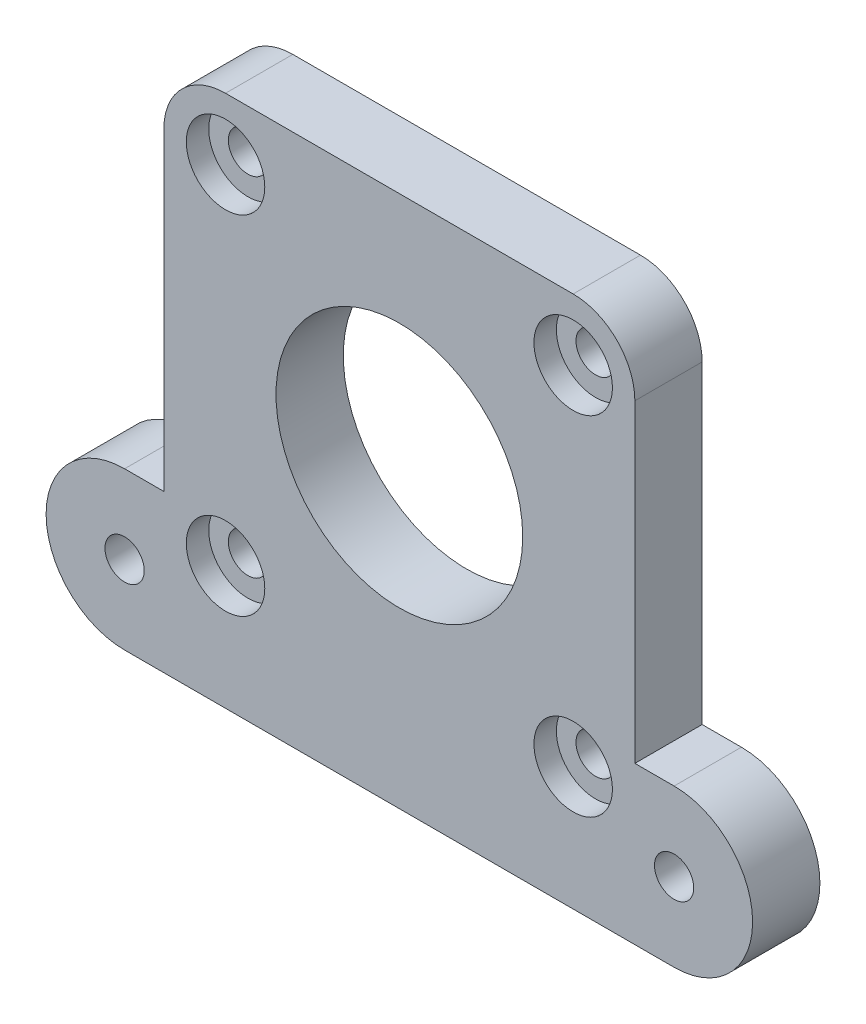
ISO-10303-21;
HEADER;
FILE_DESCRIPTION(('STEP AP214'),'2;1');
FILE_NAME('part.step','',(''),(''),'','','');
FILE_SCHEMA(('AUTOMOTIVE_DESIGN { 1 0 10303 214 1 1 1 1 }'));
ENDSEC;
DATA;
#1=APPLICATION_CONTEXT('core data for automotive mechanical design processes');
#2=APPLICATION_PROTOCOL_DEFINITION('international standard','automotive_design',2000,#1);
#3=PRODUCT_CONTEXT('',#1,'mechanical');
#4=PRODUCT('Part','Part','',(#3));
#5=PRODUCT_RELATED_PRODUCT_CATEGORY('part','',(#4));
#6=PRODUCT_DEFINITION_FORMATION('','',#4);
#7=PRODUCT_DEFINITION_CONTEXT('part definition',#1,'design');
#8=PRODUCT_DEFINITION('design','',#6,#7);
#9=PRODUCT_DEFINITION_SHAPE('','',#8);
#10=(LENGTH_UNIT() NAMED_UNIT(*) SI_UNIT(.MILLI.,.METRE.));
#11=(NAMED_UNIT(*) PLANE_ANGLE_UNIT() SI_UNIT($,.RADIAN.));
#12=(NAMED_UNIT(*) SI_UNIT($,.STERADIAN.) SOLID_ANGLE_UNIT());
#13=UNCERTAINTY_MEASURE_WITH_UNIT(LENGTH_MEASURE(1.E-05),#10,'distance_accuracy_value','');
#14=(GEOMETRIC_REPRESENTATION_CONTEXT(3) GLOBAL_UNCERTAINTY_ASSIGNED_CONTEXT((#13)) GLOBAL_UNIT_ASSIGNED_CONTEXT((#10,
#11,#12)) REPRESENTATION_CONTEXT('',''));
#15=CARTESIAN_POINT('',(0.,0.,0.));
#16=DIRECTION('',(0.,0.,1.));
#17=DIRECTION('',(1.,0.,0.));
#18=AXIS2_PLACEMENT_3D('',#15,#16,#17);
#19=CARTESIAN_POINT('',(15.5,18.25,6.));
#20=DIRECTION('',(0.,0.,-1.));
#21=DIRECTION('',(-1.,0.,0.));
#22=AXIS2_PLACEMENT_3D('',#19,#20,#21);
#23=CYLINDRICAL_SURFACE('',#22,1.75);
#24=CARTESIAN_POINT('',(15.5,18.25,0.));
#25=DIRECTION('',(0.,0.,1.));
#26=DIRECTION('',(1.,0.,0.));
#27=AXIS2_PLACEMENT_3D('',#24,#25,#26);
#28=CIRCLE('',#27,1.75);
#29=CARTESIAN_POINT('',(17.25,18.25,0.));
#30=VERTEX_POINT('',#29);
#31=EDGE_CURVE('E187',#30,#30,#28,.T.);
#32=ORIENTED_EDGE('',*,*,#31,.F.);
#33=EDGE_LOOP('',(#32));
#34=FACE_BOUND('',#33,.T.);
#35=CARTESIAN_POINT('',(15.5,18.25,4.));
#36=DIRECTION('',(0.,0.,1.));
#37=DIRECTION('',(1.,0.,0.));
#38=AXIS2_PLACEMENT_3D('',#35,#36,#37);
#39=CIRCLE('',#38,1.75);
#40=CARTESIAN_POINT('',(17.25,18.25,4.));
#41=VERTEX_POINT('',#40);
#42=EDGE_CURVE('E37',#41,#41,#39,.T.);
#43=ORIENTED_EDGE('',*,*,#42,.T.);
#44=EDGE_LOOP('',(#43));
#45=FACE_BOUND('',#44,.T.);
#46=ADVANCED_FACE('F33',(#34,#45),#23,.F.);
#47=CARTESIAN_POINT('',(15.5,-12.75,6.));
#48=DIRECTION('',(0.,0.,-1.));
#49=DIRECTION('',(-1.,0.,0.));
#50=AXIS2_PLACEMENT_3D('',#47,#48,#49);
#51=CYLINDRICAL_SURFACE('',#50,1.75);
#52=CARTESIAN_POINT('',(15.5,-12.75,0.));
#53=DIRECTION('',(0.,0.,1.));
#54=DIRECTION('',(-1.,0.,0.));
#55=AXIS2_PLACEMENT_3D('',#52,#53,#54);
#56=CIRCLE('',#55,1.75);
#57=CARTESIAN_POINT('',(13.75,-12.75,0.));
#58=VERTEX_POINT('',#57);
#59=EDGE_CURVE('E184',#58,#58,#56,.T.);
#60=ORIENTED_EDGE('',*,*,#59,.F.);
#61=EDGE_LOOP('',(#60));
#62=FACE_BOUND('',#61,.T.);
#63=CARTESIAN_POINT('',(15.5,-12.75,4.));
#64=DIRECTION('',(0.,0.,1.));
#65=DIRECTION('',(1.,0.,0.));
#66=AXIS2_PLACEMENT_3D('',#63,#64,#65);
#67=CIRCLE('',#66,1.75);
#68=CARTESIAN_POINT('',(17.25,-12.75,4.));
#69=VERTEX_POINT('',#68);
#70=EDGE_CURVE('E161',#69,#69,#67,.T.);
#71=ORIENTED_EDGE('',*,*,#70,.T.);
#72=EDGE_LOOP('',(#71));
#73=FACE_BOUND('',#72,.T.);
#74=ADVANCED_FACE('F278',(#62,#73),#51,.F.);
#75=CARTESIAN_POINT('',(-15.5,18.25,6.));
#76=DIRECTION('',(0.,0.,-1.));
#77=DIRECTION('',(-1.,0.,0.));
#78=AXIS2_PLACEMENT_3D('',#75,#76,#77);
#79=CYLINDRICAL_SURFACE('',#78,1.75);
#80=CARTESIAN_POINT('',(-15.5,18.25,0.));
#81=DIRECTION('',(0.,0.,1.));
#82=DIRECTION('',(-1.,0.,0.));
#83=AXIS2_PLACEMENT_3D('',#80,#81,#82);
#84=CIRCLE('',#83,1.75);
#85=CARTESIAN_POINT('',(-17.25,18.25,0.));
#86=VERTEX_POINT('',#85);
#87=EDGE_CURVE('E181',#86,#86,#84,.T.);
#88=ORIENTED_EDGE('',*,*,#87,.F.);
#89=EDGE_LOOP('',(#88));
#90=FACE_BOUND('',#89,.T.);
#91=CARTESIAN_POINT('',(-15.5,18.25,4.));
#92=DIRECTION('',(0.,0.,1.));
#93=DIRECTION('',(1.,0.,0.));
#94=AXIS2_PLACEMENT_3D('',#91,#92,#93);
#95=CIRCLE('',#94,1.75);
#96=CARTESIAN_POINT('',(-13.75,18.25,4.));
#97=VERTEX_POINT('',#96);
#98=EDGE_CURVE('E158',#97,#97,#95,.T.);
#99=ORIENTED_EDGE('',*,*,#98,.T.);
#100=EDGE_LOOP('',(#99));
#101=FACE_BOUND('',#100,.T.);
#102=ADVANCED_FACE('F284',(#90,#101),#79,.F.);
#103=CARTESIAN_POINT('',(-15.5,-12.75,6.));
#104=DIRECTION('',(0.,0.,-1.));
#105=DIRECTION('',(-1.,0.,0.));
#106=AXIS2_PLACEMENT_3D('',#103,#104,#105);
#107=CYLINDRICAL_SURFACE('',#106,1.75);
#108=CARTESIAN_POINT('',(-15.5,-12.75,0.));
#109=DIRECTION('',(0.,0.,1.));
#110=DIRECTION('',(1.,0.,0.));
#111=AXIS2_PLACEMENT_3D('',#108,#109,#110);
#112=CIRCLE('',#111,1.75);
#113=CARTESIAN_POINT('',(-13.75,-12.75,0.));
#114=VERTEX_POINT('',#113);
#115=EDGE_CURVE('E175',#114,#114,#112,.T.);
#116=ORIENTED_EDGE('',*,*,#115,.F.);
#117=EDGE_LOOP('',(#116));
#118=FACE_BOUND('',#117,.T.);
#119=CARTESIAN_POINT('',(-15.5,-12.75,4.));
#120=DIRECTION('',(0.,0.,1.));
#121=DIRECTION('',(1.,0.,0.));
#122=AXIS2_PLACEMENT_3D('',#119,#120,#121);
#123=CIRCLE('',#122,1.75);
#124=CARTESIAN_POINT('',(-13.75,-12.75,4.));
#125=VERTEX_POINT('',#124);
#126=EDGE_CURVE('E155',#125,#125,#123,.T.);
#127=ORIENTED_EDGE('',*,*,#126,.T.);
#128=EDGE_LOOP('',(#127));
#129=FACE_BOUND('',#128,.T.);
#130=ADVANCED_FACE('F300',(#118,#129),#107,.F.);
#131=CARTESIAN_POINT('',(24.5,-16.75,6.));
#132=DIRECTION('',(0.,0.,1.));
#133=DIRECTION('',(1.,0.,0.));
#134=AXIS2_PLACEMENT_3D('',#131,#132,#133);
#135=PLANE('',#134);
#136=CARTESIAN_POINT('',(-15.5,18.25,6.));
#137=DIRECTION('',(0.,0.,1.));
#138=DIRECTION('',(1.,0.,0.));
#139=AXIS2_PLACEMENT_3D('',#136,#137,#138);
#140=CIRCLE('',#139,3.5);
#141=CARTESIAN_POINT('',(-12.,18.25,6.));
#142=VERTEX_POINT('',#141);
#143=EDGE_CURVE('E349',#142,#142,#140,.T.);
#144=ORIENTED_EDGE('',*,*,#143,.F.);
#145=EDGE_LOOP('',(#144));
#146=FACE_BOUND('',#145,.T.);
#147=CARTESIAN_POINT('',(-15.5,-12.75,6.));
#148=DIRECTION('',(0.,0.,1.));
#149=DIRECTION('',(1.,0.,0.));
#150=AXIS2_PLACEMENT_3D('',#147,#148,#149);
#151=CIRCLE('',#150,3.5);
#152=CARTESIAN_POINT('',(-12.,-12.75,6.));
#153=VERTEX_POINT('',#152);
#154=EDGE_CURVE('E348',#153,#153,#151,.T.);
#155=ORIENTED_EDGE('',*,*,#154,.F.);
#156=EDGE_LOOP('',(#155));
#157=FACE_BOUND('',#156,.T.);
#158=CARTESIAN_POINT('',(15.5,-12.75,6.));
#159=DIRECTION('',(0.,0.,1.));
#160=DIRECTION('',(1.,0.,0.));
#161=AXIS2_PLACEMENT_3D('',#158,#159,#160);
#162=CIRCLE('',#161,3.5);
#163=CARTESIAN_POINT('',(19.,-12.75,6.));
#164=VERTEX_POINT('',#163);
#165=EDGE_CURVE('E365',#164,#164,#162,.T.);
#166=ORIENTED_EDGE('',*,*,#165,.F.);
#167=EDGE_LOOP('',(#166));
#168=FACE_BOUND('',#167,.T.);
#169=CARTESIAN_POINT('',(15.5,18.25,6.));
#170=DIRECTION('',(0.,0.,1.));
#171=DIRECTION('',(1.,0.,0.));
#172=AXIS2_PLACEMENT_3D('',#169,#170,#171);
#173=CIRCLE('',#172,3.5);
#174=CARTESIAN_POINT('',(19.,18.25,6.));
#175=VERTEX_POINT('',#174);
#176=EDGE_CURVE('E359',#175,#175,#173,.T.);
#177=ORIENTED_EDGE('',*,*,#176,.F.);
#178=EDGE_LOOP('',(#177));
#179=FACE_BOUND('',#178,.T.);
#180=CARTESIAN_POINT('',(0.,2.75000000000001,6.));
#181=DIRECTION('',(0.,0.,1.));
#182=DIRECTION('',(1.,0.,0.));
#183=AXIS2_PLACEMENT_3D('',#180,#181,#182);
#184=CIRCLE('',#183,11.);
#185=CARTESIAN_POINT('',(11.,2.75000000000001,6.));
#186=VERTEX_POINT('',#185);
#187=EDGE_CURVE('E191',#186,#186,#184,.T.);
#188=ORIENTED_EDGE('',*,*,#187,.F.);
#189=EDGE_LOOP('',(#188));
#190=FACE_BOUND('',#189,.T.);
#191=DIRECTION('',(0.,1.,0.));
#192=VECTOR('',#191,1.);
#193=CARTESIAN_POINT('',(21.,23.75,6.));
#194=LINE('',#193,#192);
#195=CARTESIAN_POINT('',(21.,-9.75000000000001,6.));
#196=VERTEX_POINT('',#195);
#197=CARTESIAN_POINT('',(21.,18.25,6.));
#198=VERTEX_POINT('',#197);
#199=EDGE_CURVE('E204',#196,#198,#194,.T.);
#200=ORIENTED_EDGE('',*,*,#199,.T.);
#201=CARTESIAN_POINT('',(15.5,18.25,6.));
#202=DIRECTION('',(0.,0.,1.));
#203=DIRECTION('',(1.,0.,0.));
#204=AXIS2_PLACEMENT_3D('',#201,#202,#203);
#205=CIRCLE('',#204,5.5);
#206=CARTESIAN_POINT('',(15.5,23.75,6.));
#207=VERTEX_POINT('',#206);
#208=EDGE_CURVE('E42',#198,#207,#205,.T.);
#209=ORIENTED_EDGE('',*,*,#208,.T.);
#210=DIRECTION('',(-1.,0.,0.));
#211=VECTOR('',#210,1.);
#212=CARTESIAN_POINT('',(-21.,23.75,6.));
#213=LINE('',#212,#211);
#214=CARTESIAN_POINT('',(-15.5,23.75,6.));
#215=VERTEX_POINT('',#214);
#216=EDGE_CURVE('E206',#207,#215,#213,.T.);
#217=ORIENTED_EDGE('',*,*,#216,.T.);
#218=CARTESIAN_POINT('',(-15.5,18.25,6.));
#219=DIRECTION('',(0.,0.,1.));
#220=DIRECTION('',(1.,0.,0.));
#221=AXIS2_PLACEMENT_3D('',#218,#219,#220);
#222=CIRCLE('',#221,5.5);
#223=CARTESIAN_POINT('',(-21.,18.25,6.));
#224=VERTEX_POINT('',#223);
#225=EDGE_CURVE('E50',#215,#224,#222,.T.);
#226=ORIENTED_EDGE('',*,*,#225,.T.);
#227=DIRECTION('',(0.,-1.,0.));
#228=VECTOR('',#227,1.);
#229=CARTESIAN_POINT('',(-21.,23.75,6.));
#230=LINE('',#229,#228);
#231=CARTESIAN_POINT('',(-21.,-9.75000000000001,6.));
#232=VERTEX_POINT('',#231);
#233=EDGE_CURVE('E208',#224,#232,#230,.T.);
#234=ORIENTED_EDGE('',*,*,#233,.T.);
#235=DIRECTION('',(-1.,0.,0.));
#236=VECTOR('',#235,1.);
#237=CARTESIAN_POINT('',(-24.5,-9.75000000000001,6.));
#238=LINE('',#237,#236);
#239=CARTESIAN_POINT('',(-24.5,-9.75000000000001,6.));
#240=VERTEX_POINT('',#239);
#241=EDGE_CURVE('E210',#232,#240,#238,.T.);
#242=ORIENTED_EDGE('',*,*,#241,.T.);
#243=CARTESIAN_POINT('',(-24.5,-16.75,6.));
#244=DIRECTION('',(0.,0.,1.));
#245=DIRECTION('',(-1.,0.,0.));
#246=AXIS2_PLACEMENT_3D('',#243,#244,#245);
#247=CIRCLE('',#246,6.99999999999999);
#248=CARTESIAN_POINT('',(-24.5,-23.75,6.));
#249=VERTEX_POINT('',#248);
#250=EDGE_CURVE('E130',#240,#249,#247,.T.);
#251=ORIENTED_EDGE('',*,*,#250,.T.);
#252=DIRECTION('',(1.,0.,0.));
#253=VECTOR('',#252,1.);
#254=CARTESIAN_POINT('',(21.,-23.75,6.));
#255=LINE('',#254,#253);
#256=CARTESIAN_POINT('',(24.5,-23.75,6.));
#257=VERTEX_POINT('',#256);
#258=EDGE_CURVE('E124',#249,#257,#255,.T.);
#259=ORIENTED_EDGE('',*,*,#258,.T.);
#260=CARTESIAN_POINT('',(24.5,-16.75,6.));
#261=DIRECTION('',(0.,0.,1.));
#262=DIRECTION('',(1.,0.,0.));
#263=AXIS2_PLACEMENT_3D('',#260,#261,#262);
#264=CIRCLE('',#263,6.99999999999999);
#265=CARTESIAN_POINT('',(24.5,-9.75000000000001,6.));
#266=VERTEX_POINT('',#265);
#267=EDGE_CURVE('E115',#257,#266,#264,.T.);
#268=ORIENTED_EDGE('',*,*,#267,.T.);
#269=DIRECTION('',(-1.,0.,0.));
#270=VECTOR('',#269,1.);
#271=CARTESIAN_POINT('',(24.5,-9.75000000000001,6.));
#272=LINE('',#271,#270);
#273=EDGE_CURVE('E123',#266,#196,#272,.T.);
#274=ORIENTED_EDGE('',*,*,#273,.T.);
#275=EDGE_LOOP('',(#200,#209,#217,#226,#234,#242,#251,#259,#268,#274));
#276=FACE_BOUND('',#275,.T.);
#277=CARTESIAN_POINT('',(24.5,-16.75,6.));
#278=DIRECTION('',(0.,0.,1.));
#279=DIRECTION('',(1.,0.,0.));
#280=AXIS2_PLACEMENT_3D('',#277,#278,#279);
#281=CIRCLE('',#280,1.74999999999999);
#282=CARTESIAN_POINT('',(26.25,-16.75,6.));
#283=VERTEX_POINT('',#282);
#284=EDGE_CURVE('E197',#283,#283,#281,.T.);
#285=ORIENTED_EDGE('',*,*,#284,.F.);
#286=EDGE_LOOP('',(#285));
#287=FACE_BOUND('',#286,.T.);
#288=CARTESIAN_POINT('',(-24.5,-16.75,6.));
#289=DIRECTION('',(0.,0.,1.));
#290=DIRECTION('',(-1.,0.,0.));
#291=AXIS2_PLACEMENT_3D('',#288,#289,#290);
#292=CIRCLE('',#291,1.74999999999999);
#293=CARTESIAN_POINT('',(-26.25,-16.75,6.));
#294=VERTEX_POINT('',#293);
#295=EDGE_CURVE('E170',#294,#294,#292,.T.);
#296=ORIENTED_EDGE('',*,*,#295,.F.);
#297=EDGE_LOOP('',(#296));
#298=FACE_BOUND('',#297,.T.);
#299=ADVANCED_FACE('F127',(#146,#157,#168,#179,#190,#276,#287,#298),#135,.T.);
#300=CARTESIAN_POINT('',(24.5,-16.75,0.));
#301=DIRECTION('',(0.,0.,1.));
#302=DIRECTION('',(1.,0.,0.));
#303=AXIS2_PLACEMENT_3D('',#300,#301,#302);
#304=PLANE('',#303);
#305=DIRECTION('',(-1.,0.,0.));
#306=VECTOR('',#305,1.);
#307=CARTESIAN_POINT('',(-21.,23.75,0.));
#308=LINE('',#307,#306);
#309=CARTESIAN_POINT('',(15.5,23.75,0.));
#310=VERTEX_POINT('',#309);
#311=CARTESIAN_POINT('',(-15.5,23.75,0.));
#312=VERTEX_POINT('',#311);
#313=EDGE_CURVE('E219',#310,#312,#308,.T.);
#314=ORIENTED_EDGE('',*,*,#313,.F.);
#315=CARTESIAN_POINT('',(15.5,18.25,0.));
#316=DIRECTION('',(0.,0.,1.));
#317=DIRECTION('',(1.,0.,0.));
#318=AXIS2_PLACEMENT_3D('',#315,#316,#317);
#319=CIRCLE('',#318,5.5);
#320=CARTESIAN_POINT('',(21.,18.25,0.));
#321=VERTEX_POINT('',#320);
#322=EDGE_CURVE('E150',#310,#321,#319,.F.);
#323=ORIENTED_EDGE('',*,*,#322,.T.);
#324=DIRECTION('',(0.,1.,0.));
#325=VECTOR('',#324,1.);
#326=CARTESIAN_POINT('',(21.,23.75,0.));
#327=LINE('',#326,#325);
#328=CARTESIAN_POINT('',(21.,-9.75000000000001,0.));
#329=VERTEX_POINT('',#328);
#330=EDGE_CURVE('E217',#329,#321,#327,.T.);
#331=ORIENTED_EDGE('',*,*,#330,.F.);
#332=DIRECTION('',(-1.,0.,0.));
#333=VECTOR('',#332,1.);
#334=CARTESIAN_POINT('',(24.5,-9.75000000000001,0.));
#335=LINE('',#334,#333);
#336=CARTESIAN_POINT('',(24.5,-9.75000000000001,0.));
#337=VERTEX_POINT('',#336);
#338=EDGE_CURVE('E215',#337,#329,#335,.T.);
#339=ORIENTED_EDGE('',*,*,#338,.F.);
#340=CARTESIAN_POINT('',(24.5,-16.75,0.));
#341=DIRECTION('',(0.,0.,1.));
#342=DIRECTION('',(1.,0.,0.));
#343=AXIS2_PLACEMENT_3D('',#340,#341,#342);
#344=CIRCLE('',#343,6.99999999999999);
#345=CARTESIAN_POINT('',(24.5,-23.75,0.));
#346=VERTEX_POINT('',#345);
#347=EDGE_CURVE('E200',#346,#337,#344,.T.);
#348=ORIENTED_EDGE('',*,*,#347,.F.);
#349=DIRECTION('',(1.,0.,0.));
#350=VECTOR('',#349,1.);
#351=CARTESIAN_POINT('',(-21.,-23.75,0.));
#352=LINE('',#351,#350);
#353=CARTESIAN_POINT('',(-24.5,-23.75,0.));
#354=VERTEX_POINT('',#353);
#355=EDGE_CURVE('E134',#354,#346,#352,.T.);
#356=ORIENTED_EDGE('',*,*,#355,.F.);
#357=CARTESIAN_POINT('',(-24.5,-16.75,0.));
#358=DIRECTION('',(0.,0.,1.));
#359=DIRECTION('',(-1.,0.,0.));
#360=AXIS2_PLACEMENT_3D('',#357,#358,#359);
#361=CIRCLE('',#360,6.99999999999999);
#362=CARTESIAN_POINT('',(-24.5,-9.75000000000001,0.));
#363=VERTEX_POINT('',#362);
#364=EDGE_CURVE('E226',#363,#354,#361,.T.);
#365=ORIENTED_EDGE('',*,*,#364,.F.);
#366=DIRECTION('',(-1.,0.,0.));
#367=VECTOR('',#366,1.);
#368=CARTESIAN_POINT('',(-24.5,-9.75000000000001,0.));
#369=LINE('',#368,#367);
#370=CARTESIAN_POINT('',(-21.,-9.75000000000001,0.));
#371=VERTEX_POINT('',#370);
#372=EDGE_CURVE('E224',#371,#363,#369,.T.);
#373=ORIENTED_EDGE('',*,*,#372,.F.);
#374=DIRECTION('',(0.,-1.,0.));
#375=VECTOR('',#374,1.);
#376=CARTESIAN_POINT('',(-21.,23.75,0.));
#377=LINE('',#376,#375);
#378=CARTESIAN_POINT('',(-21.,18.25,0.));
#379=VERTEX_POINT('',#378);
#380=EDGE_CURVE('E222',#379,#371,#377,.T.);
#381=ORIENTED_EDGE('',*,*,#380,.F.);
#382=CARTESIAN_POINT('',(-15.5,18.25,0.));
#383=DIRECTION('',(0.,0.,1.));
#384=DIRECTION('',(1.,0.,0.));
#385=AXIS2_PLACEMENT_3D('',#382,#383,#384);
#386=CIRCLE('',#385,5.5);
#387=EDGE_CURVE('E148',#379,#312,#386,.F.);
#388=ORIENTED_EDGE('',*,*,#387,.T.);
#389=EDGE_LOOP('',(#314,#323,#331,#339,#348,#356,#365,#373,#381,#388));
#390=FACE_BOUND('',#389,.T.);
#391=CARTESIAN_POINT('',(24.5,-16.75,0.));
#392=DIRECTION('',(0.,0.,1.));
#393=DIRECTION('',(1.,0.,0.));
#394=AXIS2_PLACEMENT_3D('',#391,#392,#393);
#395=CIRCLE('',#394,1.74999999999999);
#396=CARTESIAN_POINT('',(26.25,-16.75,0.));
#397=VERTEX_POINT('',#396);
#398=EDGE_CURVE('E194',#397,#397,#395,.T.);
#399=ORIENTED_EDGE('',*,*,#398,.T.);
#400=EDGE_LOOP('',(#399));
#401=FACE_BOUND('',#400,.T.);
#402=CARTESIAN_POINT('',(0.,2.75000000000001,0.));
#403=DIRECTION('',(0.,0.,1.));
#404=DIRECTION('',(1.,0.,0.));
#405=AXIS2_PLACEMENT_3D('',#402,#403,#404);
#406=CIRCLE('',#405,11.);
#407=CARTESIAN_POINT('',(11.,2.75000000000001,0.));
#408=VERTEX_POINT('',#407);
#409=EDGE_CURVE('E190',#408,#408,#406,.T.);
#410=ORIENTED_EDGE('',*,*,#409,.T.);
#411=EDGE_LOOP('',(#410));
#412=FACE_BOUND('',#411,.T.);
#413=ORIENTED_EDGE('',*,*,#31,.T.);
#414=EDGE_LOOP('',(#413));
#415=FACE_BOUND('',#414,.T.);
#416=ORIENTED_EDGE('',*,*,#59,.T.);
#417=EDGE_LOOP('',(#416));
#418=FACE_BOUND('',#417,.T.);
#419=ORIENTED_EDGE('',*,*,#87,.T.);
#420=EDGE_LOOP('',(#419));
#421=FACE_BOUND('',#420,.T.);
#422=ORIENTED_EDGE('',*,*,#115,.T.);
#423=EDGE_LOOP('',(#422));
#424=FACE_BOUND('',#423,.T.);
#425=CARTESIAN_POINT('',(-24.5,-16.75,0.));
#426=DIRECTION('',(0.,0.,1.));
#427=DIRECTION('',(-1.,0.,0.));
#428=AXIS2_PLACEMENT_3D('',#425,#426,#427);
#429=CIRCLE('',#428,1.74999999999999);
#430=CARTESIAN_POINT('',(-26.25,-16.75,0.));
#431=VERTEX_POINT('',#430);
#432=EDGE_CURVE('E166',#431,#431,#429,.T.);
#433=ORIENTED_EDGE('',*,*,#432,.T.);
#434=EDGE_LOOP('',(#433));
#435=FACE_BOUND('',#434,.T.);
#436=ADVANCED_FACE('F244',(#390,#401,#412,#415,#418,#421,#424,#435),#304,.F.);
#437=CARTESIAN_POINT('',(24.5,-16.75,6.));
#438=DIRECTION('',(0.,0.,-1.));
#439=DIRECTION('',(-1.,0.,0.));
#440=AXIS2_PLACEMENT_3D('',#437,#438,#439);
#441=CYLINDRICAL_SURFACE('',#440,6.99999999999999);
#442=ORIENTED_EDGE('',*,*,#347,.T.);
#443=DIRECTION('',(0.,0.,-1.));
#444=VECTOR('',#443,1.);
#445=CARTESIAN_POINT('',(24.5,-9.75000000000001,6.));
#446=LINE('',#445,#444);
#447=EDGE_CURVE('E121',#266,#337,#446,.T.);
#448=ORIENTED_EDGE('',*,*,#447,.F.);
#449=ORIENTED_EDGE('',*,*,#267,.F.);
#450=DIRECTION('',(0.,0.,-1.));
#451=VECTOR('',#450,1.);
#452=CARTESIAN_POINT('',(24.5,-23.75,6.));
#453=LINE('',#452,#451);
#454=EDGE_CURVE('E119',#257,#346,#453,.T.);
#455=ORIENTED_EDGE('',*,*,#454,.T.);
#456=EDGE_LOOP('',(#442,#448,#449,#455));
#457=FACE_BOUND('',#456,.T.);
#458=ADVANCED_FACE('F117',(#457),#441,.T.);
#459=CARTESIAN_POINT('',(24.5,-9.75000000000001,6.));
#460=DIRECTION('',(0.,-1.,0.));
#461=DIRECTION('',(1.,0.,0.));
#462=AXIS2_PLACEMENT_3D('',#459,#460,#461);
#463=PLANE('',#462);
#464=ORIENTED_EDGE('',*,*,#338,.T.);
#465=DIRECTION('',(0.,0.,-1.));
#466=VECTOR('',#465,1.);
#467=CARTESIAN_POINT('',(21.,-9.75000000000001,6.));
#468=LINE('',#467,#466);
#469=EDGE_CURVE('E142',#196,#329,#468,.T.);
#470=ORIENTED_EDGE('',*,*,#469,.F.);
#471=ORIENTED_EDGE('',*,*,#273,.F.);
#472=ORIENTED_EDGE('',*,*,#447,.T.);
#473=EDGE_LOOP('',(#464,#470,#471,#472));
#474=FACE_BOUND('',#473,.T.);
#475=ADVANCED_FACE('F306',(#474),#463,.F.);
#476=CARTESIAN_POINT('',(21.,23.75,6.));
#477=DIRECTION('',(-1.,0.,0.));
#478=DIRECTION('',(0.,0.,1.));
#479=AXIS2_PLACEMENT_3D('',#476,#477,#478);
#480=PLANE('',#479);
#481=ORIENTED_EDGE('',*,*,#330,.T.);
#482=DIRECTION('',(0.,0.,-1.));
#483=VECTOR('',#482,1.);
#484=CARTESIAN_POINT('',(21.,18.25,6.));
#485=LINE('',#484,#483);
#486=EDGE_CURVE('E58',#321,#198,#485,.F.);
#487=ORIENTED_EDGE('',*,*,#486,.T.);
#488=ORIENTED_EDGE('',*,*,#199,.F.);
#489=ORIENTED_EDGE('',*,*,#469,.T.);
#490=EDGE_LOOP('',(#481,#487,#488,#489));
#491=FACE_BOUND('',#490,.T.);
#492=ADVANCED_FACE('F239',(#491),#480,.F.);
#493=CARTESIAN_POINT('',(-21.,23.75,6.));
#494=DIRECTION('',(0.,-1.,0.));
#495=DIRECTION('',(0.,0.,-1.));
#496=AXIS2_PLACEMENT_3D('',#493,#494,#495);
#497=PLANE('',#496);
#498=ORIENTED_EDGE('',*,*,#216,.F.);
#499=DIRECTION('',(0.,0.,-1.));
#500=VECTOR('',#499,1.);
#501=CARTESIAN_POINT('',(15.5,23.75,6.));
#502=LINE('',#501,#500);
#503=EDGE_CURVE('E140',#207,#310,#502,.T.);
#504=ORIENTED_EDGE('',*,*,#503,.T.);
#505=ORIENTED_EDGE('',*,*,#313,.T.);
#506=DIRECTION('',(0.,0.,-1.));
#507=VECTOR('',#506,1.);
#508=CARTESIAN_POINT('',(-15.5,23.75,6.));
#509=LINE('',#508,#507);
#510=EDGE_CURVE('E138',#312,#215,#509,.F.);
#511=ORIENTED_EDGE('',*,*,#510,.T.);
#512=EDGE_LOOP('',(#498,#504,#505,#511));
#513=FACE_BOUND('',#512,.T.);
#514=ADVANCED_FACE('F252',(#513),#497,.F.);
#515=CARTESIAN_POINT('',(-21.,23.75,6.));
#516=DIRECTION('',(1.,0.,0.));
#517=DIRECTION('',(0.,1.,0.));
#518=AXIS2_PLACEMENT_3D('',#515,#516,#517);
#519=PLANE('',#518);
#520=ORIENTED_EDGE('',*,*,#233,.F.);
#521=DIRECTION('',(0.,0.,-1.));
#522=VECTOR('',#521,1.);
#523=CARTESIAN_POINT('',(-21.,18.25,6.));
#524=LINE('',#523,#522);
#525=EDGE_CURVE('E11',#224,#379,#524,.T.);
#526=ORIENTED_EDGE('',*,*,#525,.T.);
#527=ORIENTED_EDGE('',*,*,#380,.T.);
#528=DIRECTION('',(0.,0.,-1.));
#529=VECTOR('',#528,1.);
#530=CARTESIAN_POINT('',(-21.,-9.75000000000001,6.));
#531=LINE('',#530,#529);
#532=EDGE_CURVE('E234',#232,#371,#531,.T.);
#533=ORIENTED_EDGE('',*,*,#532,.F.);
#534=EDGE_LOOP('',(#520,#526,#527,#533));
#535=FACE_BOUND('',#534,.T.);
#536=ADVANCED_FACE('F258',(#535),#519,.F.);
#537=CARTESIAN_POINT('',(-24.5,-9.75000000000001,6.));
#538=DIRECTION('',(0.,-1.,0.));
#539=DIRECTION('',(1.,0.,0.));
#540=AXIS2_PLACEMENT_3D('',#537,#538,#539);
#541=PLANE('',#540);
#542=ORIENTED_EDGE('',*,*,#372,.T.);
#543=DIRECTION('',(0.,0.,-1.));
#544=VECTOR('',#543,1.);
#545=CARTESIAN_POINT('',(-24.5,-9.75000000000001,6.));
#546=LINE('',#545,#544);
#547=EDGE_CURVE('E231',#240,#363,#546,.T.);
#548=ORIENTED_EDGE('',*,*,#547,.F.);
#549=ORIENTED_EDGE('',*,*,#241,.F.);
#550=ORIENTED_EDGE('',*,*,#532,.T.);
#551=EDGE_LOOP('',(#542,#548,#549,#550));
#552=FACE_BOUND('',#551,.T.);
#553=ADVANCED_FACE('F264',(#552),#541,.F.);
#554=CARTESIAN_POINT('',(-24.5,-16.75,6.));
#555=DIRECTION('',(0.,0.,-1.));
#556=DIRECTION('',(-1.,0.,0.));
#557=AXIS2_PLACEMENT_3D('',#554,#555,#556);
#558=CYLINDRICAL_SURFACE('',#557,6.99999999999999);
#559=ORIENTED_EDGE('',*,*,#364,.T.);
#560=DIRECTION('',(0.,0.,-1.));
#561=VECTOR('',#560,1.);
#562=CARTESIAN_POINT('',(-24.5,-23.75,6.));
#563=LINE('',#562,#561);
#564=EDGE_CURVE('E213',#249,#354,#563,.T.);
#565=ORIENTED_EDGE('',*,*,#564,.F.);
#566=ORIENTED_EDGE('',*,*,#250,.F.);
#567=ORIENTED_EDGE('',*,*,#547,.T.);
#568=EDGE_LOOP('',(#559,#565,#566,#567));
#569=FACE_BOUND('',#568,.T.);
#570=ADVANCED_FACE('F267',(#569),#558,.T.);
#571=CARTESIAN_POINT('',(-21.,-23.75,6.));
#572=DIRECTION('',(0.,1.,0.));
#573=DIRECTION('',(0.,0.,1.));
#574=AXIS2_PLACEMENT_3D('',#571,#572,#573);
#575=PLANE('',#574);
#576=ORIENTED_EDGE('',*,*,#355,.T.);
#577=ORIENTED_EDGE('',*,*,#454,.F.);
#578=ORIENTED_EDGE('',*,*,#258,.F.);
#579=ORIENTED_EDGE('',*,*,#564,.T.);
#580=EDGE_LOOP('',(#576,#577,#578,#579));
#581=FACE_BOUND('',#580,.T.);
#582=ADVANCED_FACE('F136',(#581),#575,.F.);
#583=CARTESIAN_POINT('',(24.5,-16.75,6.));
#584=DIRECTION('',(0.,0.,-1.));
#585=DIRECTION('',(-1.,0.,0.));
#586=AXIS2_PLACEMENT_3D('',#583,#584,#585);
#587=CYLINDRICAL_SURFACE('',#586,1.74999999999999);
#588=ORIENTED_EDGE('',*,*,#284,.T.);
#589=EDGE_LOOP('',(#588));
#590=FACE_BOUND('',#589,.T.);
#591=ORIENTED_EDGE('',*,*,#398,.F.);
#592=EDGE_LOOP('',(#591));
#593=FACE_BOUND('',#592,.T.);
#594=ADVANCED_FACE('F274',(#590,#593),#587,.F.);
#595=CARTESIAN_POINT('',(0.,2.75000000000001,6.));
#596=DIRECTION('',(0.,0.,-1.));
#597=DIRECTION('',(-1.,0.,0.));
#598=AXIS2_PLACEMENT_3D('',#595,#596,#597);
#599=CYLINDRICAL_SURFACE('',#598,11.);
#600=ORIENTED_EDGE('',*,*,#187,.T.);
#601=EDGE_LOOP('',(#600));
#602=FACE_BOUND('',#601,.T.);
#603=ORIENTED_EDGE('',*,*,#409,.F.);
#604=EDGE_LOOP('',(#603));
#605=FACE_BOUND('',#604,.T.);
#606=ADVANCED_FACE('F290',(#602,#605),#599,.F.);
#607=CARTESIAN_POINT('',(-24.5,-16.75,6.));
#608=DIRECTION('',(0.,0.,-1.));
#609=DIRECTION('',(-1.,0.,0.));
#610=AXIS2_PLACEMENT_3D('',#607,#608,#609);
#611=CYLINDRICAL_SURFACE('',#610,1.74999999999999);
#612=ORIENTED_EDGE('',*,*,#295,.T.);
#613=EDGE_LOOP('',(#612));
#614=FACE_BOUND('',#613,.T.);
#615=ORIENTED_EDGE('',*,*,#432,.F.);
#616=EDGE_LOOP('',(#615));
#617=FACE_BOUND('',#616,.T.);
#618=ADVANCED_FACE('F293',(#614,#617),#611,.F.);
#619=CARTESIAN_POINT('',(15.5,18.25,6.));
#620=DIRECTION('',(0.,0.,-1.));
#621=DIRECTION('',(-1.,0.,0.));
#622=AXIS2_PLACEMENT_3D('',#619,#620,#621);
#623=CYLINDRICAL_SURFACE('',#622,5.5);
#624=ORIENTED_EDGE('',*,*,#208,.F.);
#625=ORIENTED_EDGE('',*,*,#486,.F.);
#626=ORIENTED_EDGE('',*,*,#322,.F.);
#627=ORIENTED_EDGE('',*,*,#503,.F.);
#628=EDGE_LOOP('',(#624,#625,#626,#627));
#629=FACE_BOUND('',#628,.T.);
#630=ADVANCED_FACE('F249',(#629),#623,.T.);
#631=CARTESIAN_POINT('',(-15.5,18.25,6.));
#632=DIRECTION('',(0.,0.,-1.));
#633=DIRECTION('',(-1.,0.,0.));
#634=AXIS2_PLACEMENT_3D('',#631,#632,#633);
#635=CYLINDRICAL_SURFACE('',#634,5.5);
#636=ORIENTED_EDGE('',*,*,#225,.F.);
#637=ORIENTED_EDGE('',*,*,#510,.F.);
#638=ORIENTED_EDGE('',*,*,#387,.F.);
#639=ORIENTED_EDGE('',*,*,#525,.F.);
#640=EDGE_LOOP('',(#636,#637,#638,#639));
#641=FACE_BOUND('',#640,.T.);
#642=ADVANCED_FACE('F35',(#641),#635,.T.);
#643=CARTESIAN_POINT('',(-15.5,-12.75,4.));
#644=DIRECTION('',(0.,0.,1.));
#645=DIRECTION('',(1.,0.,0.));
#646=AXIS2_PLACEMENT_3D('',#643,#644,#645);
#647=CYLINDRICAL_SURFACE('',#646,3.5);
#648=CARTESIAN_POINT('',(-15.5,-12.75,4.));
#649=DIRECTION('',(0.,0.,1.));
#650=DIRECTION('',(1.,0.,0.));
#651=AXIS2_PLACEMENT_3D('',#648,#649,#650);
#652=CIRCLE('',#651,3.5);
#653=CARTESIAN_POINT('',(-12.,-12.75,4.));
#654=VERTEX_POINT('',#653);
#655=EDGE_CURVE('E352',#654,#654,#652,.T.);
#656=ORIENTED_EDGE('',*,*,#655,.F.);
#657=EDGE_LOOP('',(#656));
#658=FACE_BOUND('',#657,.T.);
#659=ORIENTED_EDGE('',*,*,#154,.T.);
#660=EDGE_LOOP('',(#659));
#661=FACE_BOUND('',#660,.T.);
#662=ADVANCED_FACE('F318',(#658,#661),#647,.F.);
#663=CARTESIAN_POINT('',(-15.5,-12.75,4.));
#664=DIRECTION('',(0.,0.,1.));
#665=DIRECTION('',(1.,0.,0.));
#666=AXIS2_PLACEMENT_3D('',#663,#664,#665);
#667=PLANE('',#666);
#668=ORIENTED_EDGE('',*,*,#126,.F.);
#669=EDGE_LOOP('',(#668));
#670=FACE_BOUND('',#669,.T.);
#671=ORIENTED_EDGE('',*,*,#655,.T.);
#672=EDGE_LOOP('',(#671));
#673=FACE_BOUND('',#672,.T.);
#674=ADVANCED_FACE('F374',(#670,#673),#667,.T.);
#675=CARTESIAN_POINT('',(-15.5,18.25,4.));
#676=DIRECTION('',(0.,0.,1.));
#677=DIRECTION('',(1.,0.,0.));
#678=AXIS2_PLACEMENT_3D('',#675,#676,#677);
#679=CYLINDRICAL_SURFACE('',#678,3.5);
#680=CARTESIAN_POINT('',(-15.5,18.25,4.));
#681=DIRECTION('',(0.,0.,1.));
#682=DIRECTION('',(1.,0.,0.));
#683=AXIS2_PLACEMENT_3D('',#680,#681,#682);
#684=CIRCLE('',#683,3.5);
#685=CARTESIAN_POINT('',(-12.,18.25,4.));
#686=VERTEX_POINT('',#685);
#687=EDGE_CURVE('E346',#686,#686,#684,.T.);
#688=ORIENTED_EDGE('',*,*,#687,.F.);
#689=EDGE_LOOP('',(#688));
#690=FACE_BOUND('',#689,.T.);
#691=ORIENTED_EDGE('',*,*,#143,.T.);
#692=EDGE_LOOP('',(#691));
#693=FACE_BOUND('',#692,.T.);
#694=ADVANCED_FACE('F342',(#690,#693),#679,.F.);
#695=CARTESIAN_POINT('',(-15.5,18.25,4.));
#696=DIRECTION('',(0.,0.,1.));
#697=DIRECTION('',(1.,0.,0.));
#698=AXIS2_PLACEMENT_3D('',#695,#696,#697);
#699=PLANE('',#698);
#700=ORIENTED_EDGE('',*,*,#98,.F.);
#701=EDGE_LOOP('',(#700));
#702=FACE_BOUND('',#701,.T.);
#703=ORIENTED_EDGE('',*,*,#687,.T.);
#704=EDGE_LOOP('',(#703));
#705=FACE_BOUND('',#704,.T.);
#706=ADVANCED_FACE('F338',(#702,#705),#699,.T.);
#707=CARTESIAN_POINT('',(15.5,-12.75,4.));
#708=DIRECTION('',(0.,0.,1.));
#709=DIRECTION('',(1.,0.,0.));
#710=AXIS2_PLACEMENT_3D('',#707,#708,#709);
#711=CYLINDRICAL_SURFACE('',#710,3.5);
#712=CARTESIAN_POINT('',(15.5,-12.75,4.));
#713=DIRECTION('',(0.,0.,1.));
#714=DIRECTION('',(1.,0.,0.));
#715=AXIS2_PLACEMENT_3D('',#712,#713,#714);
#716=CIRCLE('',#715,3.5);
#717=CARTESIAN_POINT('',(19.,-12.75,4.));
#718=VERTEX_POINT('',#717);
#719=EDGE_CURVE('E361',#718,#718,#716,.T.);
#720=ORIENTED_EDGE('',*,*,#719,.F.);
#721=EDGE_LOOP('',(#720));
#722=FACE_BOUND('',#721,.T.);
#723=ORIENTED_EDGE('',*,*,#165,.T.);
#724=EDGE_LOOP('',(#723));
#725=FACE_BOUND('',#724,.T.);
#726=ADVANCED_FACE('F341',(#722,#725),#711,.F.);
#727=CARTESIAN_POINT('',(15.5,-12.75,4.));
#728=DIRECTION('',(0.,0.,1.));
#729=DIRECTION('',(1.,0.,0.));
#730=AXIS2_PLACEMENT_3D('',#727,#728,#729);
#731=PLANE('',#730);
#732=ORIENTED_EDGE('',*,*,#70,.F.);
#733=EDGE_LOOP('',(#732));
#734=FACE_BOUND('',#733,.T.);
#735=ORIENTED_EDGE('',*,*,#719,.T.);
#736=EDGE_LOOP('',(#735));
#737=FACE_BOUND('',#736,.T.);
#738=ADVANCED_FACE('F412',(#734,#737),#731,.T.);
#739=CARTESIAN_POINT('',(15.5,18.25,4.));
#740=DIRECTION('',(0.,0.,1.));
#741=DIRECTION('',(1.,0.,0.));
#742=AXIS2_PLACEMENT_3D('',#739,#740,#741);
#743=CYLINDRICAL_SURFACE('',#742,3.5);
#744=CARTESIAN_POINT('',(15.5,18.25,4.));
#745=DIRECTION('',(0.,0.,1.));
#746=DIRECTION('',(1.,0.,0.));
#747=AXIS2_PLACEMENT_3D('',#744,#745,#746);
#748=CIRCLE('',#747,3.5);
#749=CARTESIAN_POINT('',(19.,18.25,4.));
#750=VERTEX_POINT('',#749);
#751=EDGE_CURVE('E159',#750,#750,#748,.T.);
#752=ORIENTED_EDGE('',*,*,#751,.F.);
#753=EDGE_LOOP('',(#752));
#754=FACE_BOUND('',#753,.T.);
#755=ORIENTED_EDGE('',*,*,#176,.T.);
#756=EDGE_LOOP('',(#755));
#757=FACE_BOUND('',#756,.T.);
#758=ADVANCED_FACE('F326',(#754,#757),#743,.F.);
#759=CARTESIAN_POINT('',(15.5,18.25,4.));
#760=DIRECTION('',(0.,0.,1.));
#761=DIRECTION('',(1.,0.,0.));
#762=AXIS2_PLACEMENT_3D('',#759,#760,#761);
#763=PLANE('',#762);
#764=ORIENTED_EDGE('',*,*,#42,.F.);
#765=EDGE_LOOP('',(#764));
#766=FACE_BOUND('',#765,.T.);
#767=ORIENTED_EDGE('',*,*,#751,.T.);
#768=EDGE_LOOP('',(#767));
#769=FACE_BOUND('',#768,.T.);
#770=ADVANCED_FACE('F406',(#766,#769),#763,.T.);
#771=CLOSED_SHELL('',(#46,#74,#102,#130,#299,#436,#458,#475,#492,#514,#536,#553,#570,#582,#594,
#606,#618,#630,#642,#662,#674,#694,#706,#726,#738,#758,#770));
#772=MANIFOLD_SOLID_BREP('B2',#771);
#773=ADVANCED_BREP_SHAPE_REPRESENTATION('',(#18,#772),#14);
#774=SHAPE_DEFINITION_REPRESENTATION(#9,#773);
ENDSEC;
END-ISO-10303-21;
